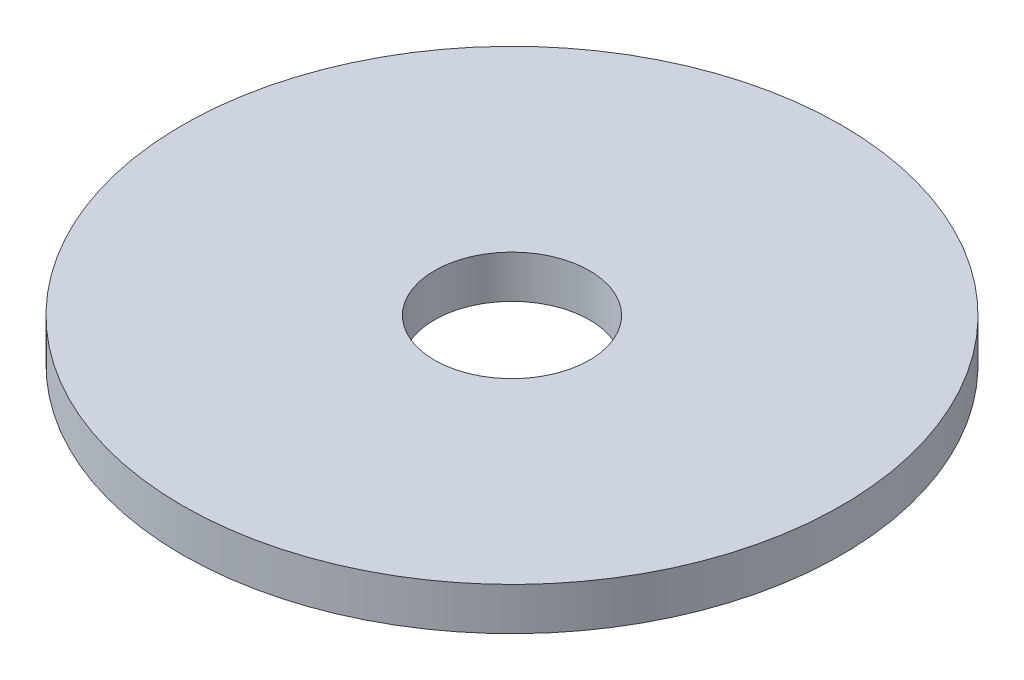
ISO-10303-21;
HEADER;
FILE_DESCRIPTION(('STEP AP214'),'2;1');
FILE_NAME('part.step','',(''),(''),'','','');
FILE_SCHEMA(('AUTOMOTIVE_DESIGN { 1 0 10303 214 1 1 1 1 }'));
ENDSEC;
DATA;
#1=APPLICATION_CONTEXT('core data for automotive mechanical design processes');
#2=APPLICATION_PROTOCOL_DEFINITION('international standard','automotive_design',2000,#1);
#3=PRODUCT_CONTEXT('',#1,'mechanical');
#4=PRODUCT('Part','Part','',(#3));
#5=PRODUCT_RELATED_PRODUCT_CATEGORY('part','',(#4));
#6=PRODUCT_DEFINITION_FORMATION('','',#4);
#7=PRODUCT_DEFINITION_CONTEXT('part definition',#1,'design');
#8=PRODUCT_DEFINITION('design','',#6,#7);
#9=PRODUCT_DEFINITION_SHAPE('','',#8);
#10=(LENGTH_UNIT() NAMED_UNIT(*) SI_UNIT(.MILLI.,.METRE.));
#11=(NAMED_UNIT(*) PLANE_ANGLE_UNIT() SI_UNIT($,.RADIAN.));
#12=(NAMED_UNIT(*) SI_UNIT($,.STERADIAN.) SOLID_ANGLE_UNIT());
#13=UNCERTAINTY_MEASURE_WITH_UNIT(LENGTH_MEASURE(1.E-05),#10,'distance_accuracy_value','');
#14=(GEOMETRIC_REPRESENTATION_CONTEXT(3) GLOBAL_UNCERTAINTY_ASSIGNED_CONTEXT((#13)) GLOBAL_UNIT_ASSIGNED_CONTEXT((#10,
#11,#12)) REPRESENTATION_CONTEXT('',''));
#15=CARTESIAN_POINT('',(0.,0.,0.));
#16=DIRECTION('',(0.,0.,1.));
#17=DIRECTION('',(1.,0.,0.));
#18=AXIS2_PLACEMENT_3D('',#15,#16,#17);
#19=CARTESIAN_POINT('',(0.,11.,0.));
#20=DIRECTION('',(0.,-1.,0.));
#21=DIRECTION('',(0.,0.,-1.));
#22=AXIS2_PLACEMENT_3D('',#19,#20,#21);
#23=CYLINDRICAL_SURFACE('',#22,85.);
#24=CARTESIAN_POINT('',(0.,11.,0.));
#25=DIRECTION('',(0.,1.,0.));
#26=DIRECTION('',(0.,0.,1.));
#27=AXIS2_PLACEMENT_3D('',#24,#25,#26);
#28=CIRCLE('',#27,85.);
#29=CARTESIAN_POINT('',(0.,11.,85.));
#30=VERTEX_POINT('',#29);
#31=EDGE_CURVE('E10',#30,#30,#28,.T.);
#32=ORIENTED_EDGE('',*,*,#31,.F.);
#33=EDGE_LOOP('',(#32));
#34=FACE_BOUND('',#33,.T.);
#35=CARTESIAN_POINT('',(0.,0.,0.));
#36=DIRECTION('',(0.,1.,0.));
#37=DIRECTION('',(0.,0.,1.));
#38=AXIS2_PLACEMENT_3D('',#35,#36,#37);
#39=CIRCLE('',#38,85.);
#40=CARTESIAN_POINT('',(0.,0.,85.));
#41=VERTEX_POINT('',#40);
#42=EDGE_CURVE('E37',#41,#41,#39,.T.);
#43=ORIENTED_EDGE('',*,*,#42,.T.);
#44=EDGE_LOOP('',(#43));
#45=FACE_BOUND('',#44,.T.);
#46=ADVANCED_FACE('F40',(#34,#45),#23,.T.);
#47=CARTESIAN_POINT('',(0.,11.,0.));
#48=DIRECTION('',(0.,1.,0.));
#49=DIRECTION('',(0.,0.,1.));
#50=AXIS2_PLACEMENT_3D('',#47,#48,#49);
#51=PLANE('',#50);
#52=CARTESIAN_POINT('',(0.,11.,0.));
#53=DIRECTION('',(0.,1.,0.));
#54=DIRECTION('',(0.,0.,1.));
#55=AXIS2_PLACEMENT_3D('',#52,#53,#54);
#56=CIRCLE('',#55,20.);
#57=CARTESIAN_POINT('',(0.,11.,20.));
#58=VERTEX_POINT('',#57);
#59=EDGE_CURVE('E50',#58,#58,#56,.T.);
#60=ORIENTED_EDGE('',*,*,#59,.F.);
#61=EDGE_LOOP('',(#60));
#62=FACE_BOUND('',#61,.T.);
#63=ORIENTED_EDGE('',*,*,#31,.T.);
#64=EDGE_LOOP('',(#63));
#65=FACE_BOUND('',#64,.T.);
#66=ADVANCED_FACE('F59',(#62,#65),#51,.T.);
#67=CARTESIAN_POINT('',(0.,0.,0.));
#68=DIRECTION('',(0.,1.,0.));
#69=DIRECTION('',(0.,0.,1.));
#70=AXIS2_PLACEMENT_3D('',#67,#68,#69);
#71=PLANE('',#70);
#72=CARTESIAN_POINT('',(0.,0.,0.));
#73=DIRECTION('',(0.,1.,0.));
#74=DIRECTION('',(0.,0.,1.));
#75=AXIS2_PLACEMENT_3D('',#72,#73,#74);
#76=CIRCLE('',#75,20.);
#77=CARTESIAN_POINT('',(0.,0.,20.));
#78=VERTEX_POINT('',#77);
#79=EDGE_CURVE('E47',#78,#78,#76,.T.);
#80=ORIENTED_EDGE('',*,*,#79,.T.);
#81=EDGE_LOOP('',(#80));
#82=FACE_BOUND('',#81,.T.);
#83=ORIENTED_EDGE('',*,*,#42,.F.);
#84=EDGE_LOOP('',(#83));
#85=FACE_BOUND('',#84,.T.);
#86=ADVANCED_FACE('F58',(#82,#85),#71,.F.);
#87=CARTESIAN_POINT('',(0.,11.,0.));
#88=DIRECTION('',(0.,-1.,0.));
#89=DIRECTION('',(0.,0.,-1.));
#90=AXIS2_PLACEMENT_3D('',#87,#88,#89);
#91=CYLINDRICAL_SURFACE('',#90,20.);
#92=ORIENTED_EDGE('',*,*,#59,.T.);
#93=EDGE_LOOP('',(#92));
#94=FACE_BOUND('',#93,.T.);
#95=ORIENTED_EDGE('',*,*,#79,.F.);
#96=EDGE_LOOP('',(#95));
#97=FACE_BOUND('',#96,.T.);
#98=ADVANCED_FACE('F54',(#94,#97),#91,.F.);
#99=CLOSED_SHELL('',(#46,#66,#86,#98));
#100=MANIFOLD_SOLID_BREP('B2',#99);
#101=ADVANCED_BREP_SHAPE_REPRESENTATION('',(#18,#100),#14);
#102=SHAPE_DEFINITION_REPRESENTATION(#9,#101);
ENDSEC;
END-ISO-10303-21;
